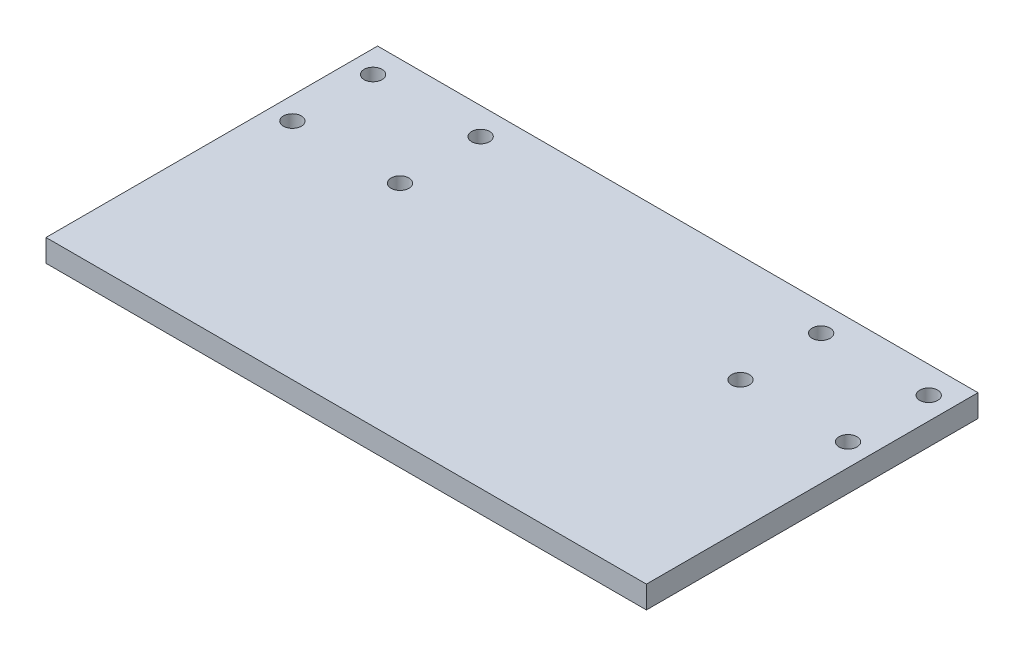
ISO-10303-21;
HEADER;
FILE_DESCRIPTION(('STEP AP214'),'2;1');
FILE_NAME('part.step','',(''),(''),'','','');
FILE_SCHEMA(('AUTOMOTIVE_DESIGN { 1 0 10303 214 1 1 1 1 }'));
ENDSEC;
DATA;
#1=APPLICATION_CONTEXT('core data for automotive mechanical design processes');
#2=APPLICATION_PROTOCOL_DEFINITION('international standard','automotive_design',2000,#1);
#3=PRODUCT_CONTEXT('',#1,'mechanical');
#4=PRODUCT('Part','Part','',(#3));
#5=PRODUCT_RELATED_PRODUCT_CATEGORY('part','',(#4));
#6=PRODUCT_DEFINITION_FORMATION('','',#4);
#7=PRODUCT_DEFINITION_CONTEXT('part definition',#1,'design');
#8=PRODUCT_DEFINITION('design','',#6,#7);
#9=PRODUCT_DEFINITION_SHAPE('','',#8);
#10=(LENGTH_UNIT() NAMED_UNIT(*) SI_UNIT(.MILLI.,.METRE.));
#11=(NAMED_UNIT(*) PLANE_ANGLE_UNIT() SI_UNIT($,.RADIAN.));
#12=(NAMED_UNIT(*) SI_UNIT($,.STERADIAN.) SOLID_ANGLE_UNIT());
#13=UNCERTAINTY_MEASURE_WITH_UNIT(LENGTH_MEASURE(1.E-05),#10,'distance_accuracy_value','');
#14=(GEOMETRIC_REPRESENTATION_CONTEXT(3) GLOBAL_UNCERTAINTY_ASSIGNED_CONTEXT((#13)) GLOBAL_UNIT_ASSIGNED_CONTEXT((#10,
#11,#12)) REPRESENTATION_CONTEXT('',''));
#15=CARTESIAN_POINT('',(0.,0.,0.));
#16=DIRECTION('',(0.,0.,1.));
#17=DIRECTION('',(1.,0.,0.));
#18=AXIS2_PLACEMENT_3D('',#15,#16,#17);
#19=CARTESIAN_POINT('',(-57.9653937947494,5.,-61.563245823389));
#20=DIRECTION('',(1.,0.,0.));
#21=DIRECTION('',(0.,0.,-1.));
#22=AXIS2_PLACEMENT_3D('',#19,#20,#21);
#23=PLANE('',#22);
#24=DIRECTION('',(0.,0.,1.));
#25=VECTOR('',#24,1.);
#26=CARTESIAN_POINT('',(-57.9653937947494,0.,-61.563245823389));
#27=LINE('',#26,#25);
#28=CARTESIAN_POINT('',(-57.9653937947494,0.,-61.563245823389));
#29=VERTEX_POINT('',#28);
#30=CARTESIAN_POINT('',(-57.9653937947494,0.,12.436754176611));
#31=VERTEX_POINT('',#30);
#32=EDGE_CURVE('E106',#29,#31,#27,.T.);
#33=ORIENTED_EDGE('',*,*,#32,.T.);
#34=DIRECTION('',(0.,-1.,0.));
#35=VECTOR('',#34,1.);
#36=CARTESIAN_POINT('',(-57.9653937947494,5.,12.436754176611));
#37=LINE('',#36,#35);
#38=CARTESIAN_POINT('',(-57.9653937947494,5.,12.436754176611));
#39=VERTEX_POINT('',#38);
#40=EDGE_CURVE('E11',#39,#31,#37,.T.);
#41=ORIENTED_EDGE('',*,*,#40,.F.);
#42=DIRECTION('',(0.,0.,1.));
#43=VECTOR('',#42,1.);
#44=CARTESIAN_POINT('',(-57.9653937947494,5.,-61.563245823389));
#45=LINE('',#44,#43);
#46=CARTESIAN_POINT('',(-57.9653937947494,5.,-61.563245823389));
#47=VERTEX_POINT('',#46);
#48=EDGE_CURVE('E90',#47,#39,#45,.T.);
#49=ORIENTED_EDGE('',*,*,#48,.F.);
#50=DIRECTION('',(0.,-1.,0.));
#51=VECTOR('',#50,1.);
#52=CARTESIAN_POINT('',(-57.9653937947494,5.,-61.563245823389));
#53=LINE('',#52,#51);
#54=EDGE_CURVE('E102',#47,#29,#53,.T.);
#55=ORIENTED_EDGE('',*,*,#54,.T.);
#56=EDGE_LOOP('',(#33,#41,#49,#55));
#57=FACE_BOUND('',#56,.T.);
#58=ADVANCED_FACE('F38',(#57),#23,.F.);
#59=CARTESIAN_POINT('',(-57.9653937947494,5.,12.436754176611));
#60=DIRECTION('',(0.,0.,-1.));
#61=DIRECTION('',(-1.,0.,0.));
#62=AXIS2_PLACEMENT_3D('',#59,#60,#61);
#63=PLANE('',#62);
#64=DIRECTION('',(1.,0.,0.));
#65=VECTOR('',#64,1.);
#66=CARTESIAN_POINT('',(-57.9653937947494,0.,12.436754176611));
#67=LINE('',#66,#65);
#68=CARTESIAN_POINT('',(76.0346062052506,0.,12.436754176611));
#69=VERTEX_POINT('',#68);
#70=EDGE_CURVE('E95',#31,#69,#67,.T.);
#71=ORIENTED_EDGE('',*,*,#70,.T.);
#72=DIRECTION('',(0.,-1.,0.));
#73=VECTOR('',#72,1.);
#74=CARTESIAN_POINT('',(76.0346062052506,5.,12.436754176611));
#75=LINE('',#74,#73);
#76=CARTESIAN_POINT('',(76.0346062052506,5.,12.436754176611));
#77=VERTEX_POINT('',#76);
#78=EDGE_CURVE('E47',#77,#69,#75,.T.);
#79=ORIENTED_EDGE('',*,*,#78,.F.);
#80=DIRECTION('',(1.,0.,0.));
#81=VECTOR('',#80,1.);
#82=CARTESIAN_POINT('',(-57.9653937947494,5.,12.436754176611));
#83=LINE('',#82,#81);
#84=EDGE_CURVE('E85',#39,#77,#83,.T.);
#85=ORIENTED_EDGE('',*,*,#84,.F.);
#86=ORIENTED_EDGE('',*,*,#40,.T.);
#87=EDGE_LOOP('',(#71,#79,#85,#86));
#88=FACE_BOUND('',#87,.T.);
#89=ADVANCED_FACE('F94',(#88),#63,.F.);
#90=CARTESIAN_POINT('',(76.0346062052506,5.,-61.563245823389));
#91=DIRECTION('',(-1.,0.,0.));
#92=DIRECTION('',(0.,0.,1.));
#93=AXIS2_PLACEMENT_3D('',#90,#91,#92);
#94=PLANE('',#93);
#95=DIRECTION('',(0.,0.,-1.));
#96=VECTOR('',#95,1.);
#97=CARTESIAN_POINT('',(76.0346062052506,0.,-61.563245823389));
#98=LINE('',#97,#96);
#99=CARTESIAN_POINT('',(76.0346062052506,0.,-61.563245823389));
#100=VERTEX_POINT('',#99);
#101=EDGE_CURVE('E72',#69,#100,#98,.T.);
#102=ORIENTED_EDGE('',*,*,#101,.T.);
#103=DIRECTION('',(0.,-1.,0.));
#104=VECTOR('',#103,1.);
#105=CARTESIAN_POINT('',(76.0346062052506,5.,-61.563245823389));
#106=LINE('',#105,#104);
#107=CARTESIAN_POINT('',(76.0346062052506,5.,-61.563245823389));
#108=VERTEX_POINT('',#107);
#109=EDGE_CURVE('E97',#108,#100,#106,.T.);
#110=ORIENTED_EDGE('',*,*,#109,.F.);
#111=DIRECTION('',(0.,0.,-1.));
#112=VECTOR('',#111,1.);
#113=CARTESIAN_POINT('',(76.0346062052506,5.,-61.563245823389));
#114=LINE('',#113,#112);
#115=EDGE_CURVE('E88',#77,#108,#114,.T.);
#116=ORIENTED_EDGE('',*,*,#115,.F.);
#117=ORIENTED_EDGE('',*,*,#78,.T.);
#118=EDGE_LOOP('',(#102,#110,#116,#117));
#119=FACE_BOUND('',#118,.T.);
#120=ADVANCED_FACE('F98',(#119),#94,.F.);
#121=CARTESIAN_POINT('',(-57.9653937947494,5.,-61.563245823389));
#122=DIRECTION('',(0.,0.,1.));
#123=DIRECTION('',(1.,0.,0.));
#124=AXIS2_PLACEMENT_3D('',#121,#122,#123);
#125=PLANE('',#124);
#126=DIRECTION('',(-1.,0.,0.));
#127=VECTOR('',#126,1.);
#128=CARTESIAN_POINT('',(-57.9653937947494,0.,-61.563245823389));
#129=LINE('',#128,#127);
#130=EDGE_CURVE('E78',#100,#29,#129,.T.);
#131=ORIENTED_EDGE('',*,*,#130,.T.);
#132=ORIENTED_EDGE('',*,*,#54,.F.);
#133=DIRECTION('',(-1.,0.,0.));
#134=VECTOR('',#133,1.);
#135=CARTESIAN_POINT('',(-57.9653937947494,5.,-61.563245823389));
#136=LINE('',#135,#134);
#137=EDGE_CURVE('E55',#108,#47,#136,.T.);
#138=ORIENTED_EDGE('',*,*,#137,.F.);
#139=ORIENTED_EDGE('',*,*,#109,.T.);
#140=EDGE_LOOP('',(#131,#132,#138,#139));
#141=FACE_BOUND('',#140,.T.);
#142=ADVANCED_FACE('F120',(#141),#125,.F.);
#143=CARTESIAN_POINT('',(0.,5.,0.));
#144=DIRECTION('',(0.,1.,0.));
#145=DIRECTION('',(0.,0.,1.));
#146=AXIS2_PLACEMENT_3D('',#143,#144,#145);
#147=PLANE('',#146);
#148=CARTESIAN_POINT('',(-28.9653937947494,5.,-55.5632458233883));
#149=DIRECTION('',(0.,1.,0.));
#150=DIRECTION('',(0.,0.,1.));
#151=AXIS2_PLACEMENT_3D('',#148,#149,#150);
#152=CIRCLE('',#151,2.);
#153=CARTESIAN_POINT('',(-28.9653937947494,5.,-53.5632458233883));
#154=VERTEX_POINT('',#153);
#155=EDGE_CURVE('E151',#154,#154,#152,.T.);
#156=ORIENTED_EDGE('',*,*,#155,.F.);
#157=EDGE_LOOP('',(#156));
#158=FACE_BOUND('',#157,.T.);
#159=CARTESIAN_POINT('',(47.0346076732778,5.,-37.5548514620401));
#160=DIRECTION('',(0.,1.,0.));
#161=DIRECTION('',(0.,0.,1.));
#162=AXIS2_PLACEMENT_3D('',#159,#160,#161);
#163=CIRCLE('',#162,1.99999999999994);
#164=CARTESIAN_POINT('',(47.0346076732778,5.,-35.5548514620402));
#165=VERTEX_POINT('',#164);
#166=EDGE_CURVE('E160',#165,#165,#163,.T.);
#167=ORIENTED_EDGE('',*,*,#166,.F.);
#168=EDGE_LOOP('',(#167));
#169=FACE_BOUND('',#168,.T.);
#170=CARTESIAN_POINT('',(71.0346062052506,5.,-37.563245823389));
#171=DIRECTION('',(0.,1.,0.));
#172=DIRECTION('',(0.,0.,1.));
#173=AXIS2_PLACEMENT_3D('',#170,#171,#172);
#174=CIRCLE('',#173,1.99999999999987);
#175=CARTESIAN_POINT('',(71.0346062052506,5.,-35.5632458233892));
#176=VERTEX_POINT('',#175);
#177=EDGE_CURVE('E135',#176,#176,#174,.T.);
#178=ORIENTED_EDGE('',*,*,#177,.F.);
#179=EDGE_LOOP('',(#178));
#180=FACE_BOUND('',#179,.T.);
#181=CARTESIAN_POINT('',(47.0346076732778,5.,-55.5548514620401));
#182=DIRECTION('',(0.,1.,0.));
#183=DIRECTION('',(0.,0.,1.));
#184=AXIS2_PLACEMENT_3D('',#181,#182,#183);
#185=CIRCLE('',#184,2.0000000000002);
#186=CARTESIAN_POINT('',(47.0346076732778,5.,-53.5548514620399));
#187=VERTEX_POINT('',#186);
#188=EDGE_CURVE('E144',#187,#187,#185,.T.);
#189=ORIENTED_EDGE('',*,*,#188,.F.);
#190=EDGE_LOOP('',(#189));
#191=FACE_BOUND('',#190,.T.);
#192=CARTESIAN_POINT('',(-52.965392326722,5.,-37.5548514620396));
#193=DIRECTION('',(0.,1.,0.));
#194=DIRECTION('',(0.,0.,1.));
#195=AXIS2_PLACEMENT_3D('',#192,#193,#194);
#196=CIRCLE('',#195,2.);
#197=CARTESIAN_POINT('',(-52.965392326722,5.,-35.5548514620396));
#198=VERTEX_POINT('',#197);
#199=EDGE_CURVE('E183',#198,#198,#196,.T.);
#200=ORIENTED_EDGE('',*,*,#199,.F.);
#201=EDGE_LOOP('',(#200));
#202=FACE_BOUND('',#201,.T.);
#203=CARTESIAN_POINT('',(-28.9653937947491,5.,-37.5632458233883));
#204=DIRECTION('',(0.,1.,0.));
#205=DIRECTION('',(0.,0.,1.));
#206=AXIS2_PLACEMENT_3D('',#203,#204,#205);
#207=CIRCLE('',#206,2.);
#208=CARTESIAN_POINT('',(-28.9653937947491,5.,-35.5632458233883));
#209=VERTEX_POINT('',#208);
#210=EDGE_CURVE('E167',#209,#209,#207,.T.);
#211=ORIENTED_EDGE('',*,*,#210,.F.);
#212=EDGE_LOOP('',(#211));
#213=FACE_BOUND('',#212,.T.);
#214=CARTESIAN_POINT('',(-52.965392326722,5.,-55.5548514620401));
#215=DIRECTION('',(0.,1.,0.));
#216=DIRECTION('',(0.,0.,1.));
#217=AXIS2_PLACEMENT_3D('',#214,#215,#216);
#218=CIRCLE('',#217,2.);
#219=CARTESIAN_POINT('',(-52.965392326722,5.,-53.5548514620401));
#220=VERTEX_POINT('',#219);
#221=EDGE_CURVE('E176',#220,#220,#218,.T.);
#222=ORIENTED_EDGE('',*,*,#221,.F.);
#223=EDGE_LOOP('',(#222));
#224=FACE_BOUND('',#223,.T.);
#225=CARTESIAN_POINT('',(71.0346062052506,5.,-55.563245823389));
#226=DIRECTION('',(0.,1.,0.));
#227=DIRECTION('',(0.,0.,1.));
#228=AXIS2_PLACEMENT_3D('',#225,#226,#227);
#229=CIRCLE('',#228,2.);
#230=CARTESIAN_POINT('',(71.0346062052506,5.,-53.563245823389));
#231=VERTEX_POINT('',#230);
#232=EDGE_CURVE('E127',#231,#231,#229,.T.);
#233=ORIENTED_EDGE('',*,*,#232,.F.);
#234=EDGE_LOOP('',(#233));
#235=FACE_BOUND('',#234,.T.);
#236=ORIENTED_EDGE('',*,*,#48,.T.);
#237=ORIENTED_EDGE('',*,*,#84,.T.);
#238=ORIENTED_EDGE('',*,*,#115,.T.);
#239=ORIENTED_EDGE('',*,*,#137,.T.);
#240=EDGE_LOOP('',(#236,#237,#238,#239));
#241=FACE_BOUND('',#240,.T.);
#242=ADVANCED_FACE('F86',(#158,#169,#180,#191,#202,#213,#224,#235,#241),#147,.T.);
#243=CARTESIAN_POINT('',(0.,0.,0.));
#244=DIRECTION('',(0.,1.,0.));
#245=DIRECTION('',(0.,0.,1.));
#246=AXIS2_PLACEMENT_3D('',#243,#244,#245);
#247=PLANE('',#246);
#248=CARTESIAN_POINT('',(-28.9653937947494,0.,-55.5632458233883));
#249=DIRECTION('',(0.,1.,0.));
#250=DIRECTION('',(0.,0.,1.));
#251=AXIS2_PLACEMENT_3D('',#248,#249,#250);
#252=CIRCLE('',#251,2.);
#253=CARTESIAN_POINT('',(-28.9653937947494,0.,-53.5632458233883));
#254=VERTEX_POINT('',#253);
#255=EDGE_CURVE('E155',#254,#254,#252,.T.);
#256=ORIENTED_EDGE('',*,*,#255,.T.);
#257=EDGE_LOOP('',(#256));
#258=FACE_BOUND('',#257,.T.);
#259=CARTESIAN_POINT('',(47.0346076732778,0.,-37.5548514620401));
#260=DIRECTION('',(0.,1.,0.));
#261=DIRECTION('',(0.,0.,1.));
#262=AXIS2_PLACEMENT_3D('',#259,#260,#261);
#263=CIRCLE('',#262,1.99999999999994);
#264=CARTESIAN_POINT('',(47.0346076732778,0.,-35.5548514620402));
#265=VERTEX_POINT('',#264);
#266=EDGE_CURVE('E140',#265,#265,#263,.T.);
#267=ORIENTED_EDGE('',*,*,#266,.T.);
#268=EDGE_LOOP('',(#267));
#269=FACE_BOUND('',#268,.T.);
#270=CARTESIAN_POINT('',(71.0346062052506,0.,-37.563245823389));
#271=DIRECTION('',(0.,1.,0.));
#272=DIRECTION('',(0.,0.,1.));
#273=AXIS2_PLACEMENT_3D('',#270,#271,#272);
#274=CIRCLE('',#273,1.99999999999987);
#275=CARTESIAN_POINT('',(71.0346062052506,0.,-35.5632458233892));
#276=VERTEX_POINT('',#275);
#277=EDGE_CURVE('E139',#276,#276,#274,.T.);
#278=ORIENTED_EDGE('',*,*,#277,.T.);
#279=EDGE_LOOP('',(#278));
#280=FACE_BOUND('',#279,.T.);
#281=CARTESIAN_POINT('',(47.0346076732778,0.,-55.5548514620401));
#282=DIRECTION('',(0.,1.,0.));
#283=DIRECTION('',(0.,0.,1.));
#284=AXIS2_PLACEMENT_3D('',#281,#282,#283);
#285=CIRCLE('',#284,2.0000000000002);
#286=CARTESIAN_POINT('',(47.0346076732778,0.,-53.5548514620399));
#287=VERTEX_POINT('',#286);
#288=EDGE_CURVE('E131',#287,#287,#285,.T.);
#289=ORIENTED_EDGE('',*,*,#288,.T.);
#290=EDGE_LOOP('',(#289));
#291=FACE_BOUND('',#290,.T.);
#292=CARTESIAN_POINT('',(-52.965392326722,0.,-37.5548514620396));
#293=DIRECTION('',(0.,1.,0.));
#294=DIRECTION('',(0.,0.,1.));
#295=AXIS2_PLACEMENT_3D('',#292,#293,#294);
#296=CIRCLE('',#295,2.);
#297=CARTESIAN_POINT('',(-52.965392326722,0.,-35.5548514620396));
#298=VERTEX_POINT('',#297);
#299=EDGE_CURVE('E172',#298,#298,#296,.T.);
#300=ORIENTED_EDGE('',*,*,#299,.T.);
#301=EDGE_LOOP('',(#300));
#302=FACE_BOUND('',#301,.T.);
#303=CARTESIAN_POINT('',(-28.9653937947491,0.,-37.5632458233883));
#304=DIRECTION('',(0.,1.,0.));
#305=DIRECTION('',(0.,0.,1.));
#306=AXIS2_PLACEMENT_3D('',#303,#304,#305);
#307=CIRCLE('',#306,2.);
#308=CARTESIAN_POINT('',(-28.9653937947491,0.,-35.5632458233883));
#309=VERTEX_POINT('',#308);
#310=EDGE_CURVE('E171',#309,#309,#307,.T.);
#311=ORIENTED_EDGE('',*,*,#310,.T.);
#312=EDGE_LOOP('',(#311));
#313=FACE_BOUND('',#312,.T.);
#314=CARTESIAN_POINT('',(-52.965392326722,0.,-55.5548514620401));
#315=DIRECTION('',(0.,1.,0.));
#316=DIRECTION('',(0.,0.,1.));
#317=AXIS2_PLACEMENT_3D('',#314,#315,#316);
#318=CIRCLE('',#317,2.);
#319=CARTESIAN_POINT('',(-52.965392326722,0.,-53.5548514620401));
#320=VERTEX_POINT('',#319);
#321=EDGE_CURVE('E156',#320,#320,#318,.T.);
#322=ORIENTED_EDGE('',*,*,#321,.T.);
#323=EDGE_LOOP('',(#322));
#324=FACE_BOUND('',#323,.T.);
#325=CARTESIAN_POINT('',(71.0346062052506,0.,-55.563245823389));
#326=DIRECTION('',(0.,1.,0.));
#327=DIRECTION('',(0.,0.,1.));
#328=AXIS2_PLACEMENT_3D('',#325,#326,#327);
#329=CIRCLE('',#328,2.);
#330=CARTESIAN_POINT('',(71.0346062052506,0.,-53.563245823389));
#331=VERTEX_POINT('',#330);
#332=EDGE_CURVE('E110',#331,#331,#329,.T.);
#333=ORIENTED_EDGE('',*,*,#332,.T.);
#334=EDGE_LOOP('',(#333));
#335=FACE_BOUND('',#334,.T.);
#336=ORIENTED_EDGE('',*,*,#32,.F.);
#337=ORIENTED_EDGE('',*,*,#130,.F.);
#338=ORIENTED_EDGE('',*,*,#101,.F.);
#339=ORIENTED_EDGE('',*,*,#70,.F.);
#340=EDGE_LOOP('',(#336,#337,#338,#339));
#341=FACE_BOUND('',#340,.T.);
#342=ADVANCED_FACE('F123',(#258,#269,#280,#291,#302,#313,#324,#335,#341),#247,.F.);
#343=CARTESIAN_POINT('',(71.0346062052506,0.,-55.563245823389));
#344=DIRECTION('',(0.,1.,0.));
#345=DIRECTION('',(0.,0.,1.));
#346=AXIS2_PLACEMENT_3D('',#343,#344,#345);
#347=CYLINDRICAL_SURFACE('',#346,2.);
#348=ORIENTED_EDGE('',*,*,#332,.F.);
#349=EDGE_LOOP('',(#348));
#350=FACE_BOUND('',#349,.T.);
#351=ORIENTED_EDGE('',*,*,#232,.T.);
#352=EDGE_LOOP('',(#351));
#353=FACE_BOUND('',#352,.T.);
#354=ADVANCED_FACE('F211',(#350,#353),#347,.F.);
#355=CARTESIAN_POINT('',(-52.965392326722,0.,-55.5548514620401));
#356=DIRECTION('',(0.,1.,0.));
#357=DIRECTION('',(0.,0.,1.));
#358=AXIS2_PLACEMENT_3D('',#355,#356,#357);
#359=CYLINDRICAL_SURFACE('',#358,2.);
#360=ORIENTED_EDGE('',*,*,#321,.F.);
#361=EDGE_LOOP('',(#360));
#362=FACE_BOUND('',#361,.T.);
#363=ORIENTED_EDGE('',*,*,#221,.T.);
#364=EDGE_LOOP('',(#363));
#365=FACE_BOUND('',#364,.T.);
#366=ADVANCED_FACE('F213',(#362,#365),#359,.F.);
#367=CARTESIAN_POINT('',(-28.9653937947491,0.,-37.5632458233883));
#368=DIRECTION('',(0.,1.,0.));
#369=DIRECTION('',(0.,0.,1.));
#370=AXIS2_PLACEMENT_3D('',#367,#368,#369);
#371=CYLINDRICAL_SURFACE('',#370,2.);
#372=ORIENTED_EDGE('',*,*,#310,.F.);
#373=EDGE_LOOP('',(#372));
#374=FACE_BOUND('',#373,.T.);
#375=ORIENTED_EDGE('',*,*,#210,.T.);
#376=EDGE_LOOP('',(#375));
#377=FACE_BOUND('',#376,.T.);
#378=ADVANCED_FACE('F197',(#374,#377),#371,.F.);
#379=CARTESIAN_POINT('',(-52.965392326722,0.,-37.5548514620396));
#380=DIRECTION('',(0.,1.,0.));
#381=DIRECTION('',(0.,0.,1.));
#382=AXIS2_PLACEMENT_3D('',#379,#380,#381);
#383=CYLINDRICAL_SURFACE('',#382,2.);
#384=ORIENTED_EDGE('',*,*,#299,.F.);
#385=EDGE_LOOP('',(#384));
#386=FACE_BOUND('',#385,.T.);
#387=ORIENTED_EDGE('',*,*,#199,.T.);
#388=EDGE_LOOP('',(#387));
#389=FACE_BOUND('',#388,.T.);
#390=ADVANCED_FACE('F193',(#386,#389),#383,.F.);
#391=CARTESIAN_POINT('',(47.0346076732778,0.,-55.5548514620401));
#392=DIRECTION('',(0.,1.,0.));
#393=DIRECTION('',(0.,0.,1.));
#394=AXIS2_PLACEMENT_3D('',#391,#392,#393);
#395=CYLINDRICAL_SURFACE('',#394,2.0000000000002);
#396=ORIENTED_EDGE('',*,*,#288,.F.);
#397=EDGE_LOOP('',(#396));
#398=FACE_BOUND('',#397,.T.);
#399=ORIENTED_EDGE('',*,*,#188,.T.);
#400=EDGE_LOOP('',(#399));
#401=FACE_BOUND('',#400,.T.);
#402=ADVANCED_FACE('F196',(#398,#401),#395,.F.);
#403=CARTESIAN_POINT('',(71.0346062052506,0.,-37.563245823389));
#404=DIRECTION('',(0.,1.,0.));
#405=DIRECTION('',(0.,0.,1.));
#406=AXIS2_PLACEMENT_3D('',#403,#404,#405);
#407=CYLINDRICAL_SURFACE('',#406,1.99999999999987);
#408=ORIENTED_EDGE('',*,*,#277,.F.);
#409=EDGE_LOOP('',(#408));
#410=FACE_BOUND('',#409,.T.);
#411=ORIENTED_EDGE('',*,*,#177,.T.);
#412=EDGE_LOOP('',(#411));
#413=FACE_BOUND('',#412,.T.);
#414=ADVANCED_FACE('F284',(#410,#413),#407,.F.);
#415=CARTESIAN_POINT('',(47.0346076732778,0.,-37.5548514620401));
#416=DIRECTION('',(0.,1.,0.));
#417=DIRECTION('',(0.,0.,1.));
#418=AXIS2_PLACEMENT_3D('',#415,#416,#417);
#419=CYLINDRICAL_SURFACE('',#418,1.99999999999994);
#420=ORIENTED_EDGE('',*,*,#266,.F.);
#421=EDGE_LOOP('',(#420));
#422=FACE_BOUND('',#421,.T.);
#423=ORIENTED_EDGE('',*,*,#166,.T.);
#424=EDGE_LOOP('',(#423));
#425=FACE_BOUND('',#424,.T.);
#426=ADVANCED_FACE('F294',(#422,#425),#419,.F.);
#427=CARTESIAN_POINT('',(-28.9653937947494,0.,-55.5632458233883));
#428=DIRECTION('',(0.,1.,0.));
#429=DIRECTION('',(0.,0.,1.));
#430=AXIS2_PLACEMENT_3D('',#427,#428,#429);
#431=CYLINDRICAL_SURFACE('',#430,2.);
#432=ORIENTED_EDGE('',*,*,#255,.F.);
#433=EDGE_LOOP('',(#432));
#434=FACE_BOUND('',#433,.T.);
#435=ORIENTED_EDGE('',*,*,#155,.T.);
#436=EDGE_LOOP('',(#435));
#437=FACE_BOUND('',#436,.T.);
#438=ADVANCED_FACE('F303',(#434,#437),#431,.F.);
#439=CLOSED_SHELL('',(#58,#89,#120,#142,#242,#342,#354,#366,#378,#390,#402,#414,#426,#438));
#440=MANIFOLD_SOLID_BREP('B2',#439);
#441=ADVANCED_BREP_SHAPE_REPRESENTATION('',(#18,#440),#14);
#442=SHAPE_DEFINITION_REPRESENTATION(#9,#441);
ENDSEC;
END-ISO-10303-21;
